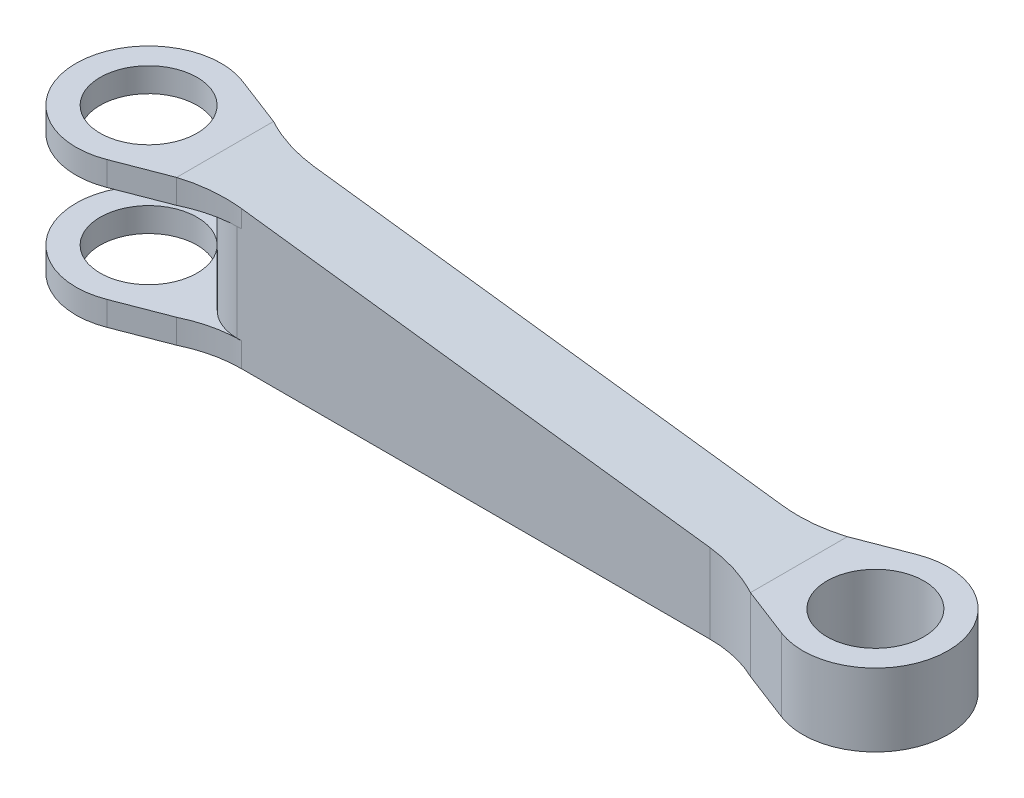
ISO-10303-21;
HEADER;
FILE_DESCRIPTION(('STEP AP214'),'2;1');
FILE_NAME('part.step','',(''),(''),'','','');
FILE_SCHEMA(('AUTOMOTIVE_DESIGN { 1 0 10303 214 1 1 1 1 }'));
ENDSEC;
DATA;
#1=APPLICATION_CONTEXT('core data for automotive mechanical design processes');
#2=APPLICATION_PROTOCOL_DEFINITION('international standard','automotive_design',2000,#1);
#3=PRODUCT_CONTEXT('',#1,'mechanical');
#4=PRODUCT('Part','Part','',(#3));
#5=PRODUCT_RELATED_PRODUCT_CATEGORY('part','',(#4));
#6=PRODUCT_DEFINITION_FORMATION('','',#4);
#7=PRODUCT_DEFINITION_CONTEXT('part definition',#1,'design');
#8=PRODUCT_DEFINITION('design','',#6,#7);
#9=PRODUCT_DEFINITION_SHAPE('','',#8);
#10=(LENGTH_UNIT() NAMED_UNIT(*) SI_UNIT(.MILLI.,.METRE.));
#11=(NAMED_UNIT(*) PLANE_ANGLE_UNIT() SI_UNIT($,.RADIAN.));
#12=(NAMED_UNIT(*) SI_UNIT($,.STERADIAN.) SOLID_ANGLE_UNIT());
#13=UNCERTAINTY_MEASURE_WITH_UNIT(LENGTH_MEASURE(1.E-05),#10,'distance_accuracy_value','');
#14=(GEOMETRIC_REPRESENTATION_CONTEXT(3) GLOBAL_UNCERTAINTY_ASSIGNED_CONTEXT((#13)) GLOBAL_UNIT_ASSIGNED_CONTEXT((#10,
#11,#12)) REPRESENTATION_CONTEXT('',''));
#15=CARTESIAN_POINT('',(0.,0.,0.));
#16=DIRECTION('',(0.,0.,1.));
#17=DIRECTION('',(1.,0.,0.));
#18=AXIS2_PLACEMENT_3D('',#15,#16,#17);
#19=CARTESIAN_POINT('',(0.,7.62,0.));
#20=DIRECTION('',(0.,-1.,0.));
#21=DIRECTION('',(0.,0.,-1.));
#22=AXIS2_PLACEMENT_3D('',#19,#20,#21);
#23=CYLINDRICAL_SURFACE('',#22,7.62);
#24=CARTESIAN_POINT('',(0.,-5.08,0.));
#25=DIRECTION('',(0.,-1.,0.));
#26=DIRECTION('',(0.,0.,-1.));
#27=AXIS2_PLACEMENT_3D('',#24,#25,#26);
#28=CIRCLE('',#27,7.62);
#29=CARTESIAN_POINT('',(2.73566372202433,-5.08,7.112));
#30=VERTEX_POINT('',#29);
#31=CARTESIAN_POINT('',(2.73566372202433,-5.08,-7.112));
#32=VERTEX_POINT('',#31);
#33=EDGE_CURVE('E183',#30,#32,#28,.T.);
#34=ORIENTED_EDGE('',*,*,#33,.T.);
#35=DIRECTION('',(0.,-1.,0.));
#36=VECTOR('',#35,1.);
#37=CARTESIAN_POINT('',(2.73566372202433,7.62,-7.112));
#38=LINE('',#37,#36);
#39=CARTESIAN_POINT('',(2.73566372202433,-7.62,-7.112));
#40=VERTEX_POINT('',#39);
#41=EDGE_CURVE('E337',#32,#40,#38,.T.);
#42=ORIENTED_EDGE('',*,*,#41,.T.);
#43=CARTESIAN_POINT('',(0.,-7.62,0.));
#44=DIRECTION('',(0.,1.,0.));
#45=DIRECTION('',(0.,0.,1.));
#46=AXIS2_PLACEMENT_3D('',#43,#44,#45);
#47=CIRCLE('',#46,7.62);
#48=CARTESIAN_POINT('',(2.73566372202433,-7.62,7.112));
#49=VERTEX_POINT('',#48);
#50=EDGE_CURVE('E332',#40,#49,#47,.T.);
#51=ORIENTED_EDGE('',*,*,#50,.T.);
#52=DIRECTION('',(0.,-1.,0.));
#53=VECTOR('',#52,1.);
#54=CARTESIAN_POINT('',(2.73566372202433,7.62,7.112));
#55=LINE('',#54,#53);
#56=EDGE_CURVE('E320',#30,#49,#55,.T.);
#57=ORIENTED_EDGE('',*,*,#56,.F.);
#58=EDGE_LOOP('',(#34,#42,#51,#57));
#59=FACE_BOUND('',#58,.T.);
#60=ADVANCED_FACE('F34',(#59),#23,.T.);
#61=CARTESIAN_POINT('',(2.73566372202433,7.62,7.112));
#62=DIRECTION('',(-0.359010987142301,0.,-0.933333333333333));
#63=DIRECTION('',(-0.933333333333333,0.,0.359010987142301));
#64=AXIS2_PLACEMENT_3D('',#61,#62,#63);
#65=PLANE('',#64);
#66=CARTESIAN_POINT('',(2.73566372202433,7.62,7.112));
#67=VERTEX_POINT('',#66);
#68=CARTESIAN_POINT('',(2.73566372202433,5.08,7.112));
#69=VERTEX_POINT('',#68);
#70=EDGE_CURVE('E255',#67,#69,#55,.T.);
#71=ORIENTED_EDGE('',*,*,#70,.T.);
#72=DIRECTION('',(0.933333333333333,0.,-0.359010987142301));
#73=VECTOR('',#72,1.);
#74=CARTESIAN_POINT('',(2.73566372202433,5.08,7.112));
#75=LINE('',#74,#73);
#76=CARTESIAN_POINT('',(8.01832470248509,5.08,5.08));
#77=VERTEX_POINT('',#76);
#78=EDGE_CURVE('E389',#69,#77,#75,.T.);
#79=ORIENTED_EDGE('',*,*,#78,.T.);
#80=DIRECTION('',(0.,-1.,0.));
#81=VECTOR('',#80,1.);
#82=CARTESIAN_POINT('',(8.01832470248509,7.62,5.08));
#83=LINE('',#82,#81);
#84=CARTESIAN_POINT('',(8.01832470248509,7.62,5.08));
#85=VERTEX_POINT('',#84);
#86=EDGE_CURVE('E195',#85,#77,#83,.T.);
#87=ORIENTED_EDGE('',*,*,#86,.F.);
#88=DIRECTION('',(0.933333333333333,0.,-0.359010987142301));
#89=VECTOR('',#88,1.);
#90=CARTESIAN_POINT('',(2.73566372202433,7.62,7.112));
#91=LINE('',#90,#89);
#92=EDGE_CURVE('E364',#67,#85,#91,.T.);
#93=ORIENTED_EDGE('',*,*,#92,.F.);
#94=EDGE_LOOP('',(#71,#79,#87,#93));
#95=FACE_BOUND('',#94,.T.);
#96=ADVANCED_FACE('F408',(#95),#65,.F.);
#97=CARTESIAN_POINT('',(2.73566372202433,7.62,-7.112));
#98=DIRECTION('',(-0.359010987142301,0.,0.933333333333333));
#99=DIRECTION('',(0.933333333333333,0.,0.359010987142301));
#100=AXIS2_PLACEMENT_3D('',#97,#98,#99);
#101=PLANE('',#100);
#102=DIRECTION('',(0.,-1.,0.));
#103=VECTOR('',#102,1.);
#104=CARTESIAN_POINT('',(8.01832470248509,7.62,-5.08));
#105=LINE('',#104,#103);
#106=CARTESIAN_POINT('',(8.01832470248509,7.62,-5.08));
#107=VERTEX_POINT('',#106);
#108=CARTESIAN_POINT('',(8.01832470248509,5.08,-5.08));
#109=VERTEX_POINT('',#108);
#110=EDGE_CURVE('E298',#107,#109,#105,.T.);
#111=ORIENTED_EDGE('',*,*,#110,.T.);
#112=DIRECTION('',(-0.933333333333333,0.,-0.359010987142301));
#113=VECTOR('',#112,1.);
#114=CARTESIAN_POINT('',(2.73566372202433,5.08,-7.112));
#115=LINE('',#114,#113);
#116=CARTESIAN_POINT('',(2.73566372202433,5.08,-7.112));
#117=VERTEX_POINT('',#116);
#118=EDGE_CURVE('E250',#109,#117,#115,.T.);
#119=ORIENTED_EDGE('',*,*,#118,.T.);
#120=CARTESIAN_POINT('',(2.73566372202433,7.62,-7.112));
#121=VERTEX_POINT('',#120);
#122=EDGE_CURVE('E311',#121,#117,#38,.T.);
#123=ORIENTED_EDGE('',*,*,#122,.F.);
#124=DIRECTION('',(-0.933333333333333,0.,-0.359010987142301));
#125=VECTOR('',#124,1.);
#126=CARTESIAN_POINT('',(2.73566372202433,7.62,-7.112));
#127=LINE('',#126,#125);
#128=EDGE_CURVE('E345',#107,#121,#127,.T.);
#129=ORIENTED_EDGE('',*,*,#128,.F.);
#130=EDGE_LOOP('',(#111,#119,#123,#129));
#131=FACE_BOUND('',#130,.T.);
#132=ADVANCED_FACE('F402',(#131),#101,.F.);
#133=CARTESIAN_POINT('',(0.,7.62,0.));
#134=DIRECTION('',(0.,-1.,0.));
#135=DIRECTION('',(0.,0.,-1.));
#136=AXIS2_PLACEMENT_3D('',#133,#134,#135);
#137=CYLINDRICAL_SURFACE('',#136,5.08);
#138=CARTESIAN_POINT('',(0.,5.08,0.));
#139=DIRECTION('',(0.,1.,0.));
#140=DIRECTION('',(0.,0.,1.));
#141=AXIS2_PLACEMENT_3D('',#138,#139,#140);
#142=CIRCLE('',#141,5.08);
#143=CARTESIAN_POINT('',(0.,5.08,-5.08));
#144=VERTEX_POINT('',#143);
#145=EDGE_CURVE('E186',#144,#144,#142,.T.);
#146=CARTESIAN_POINT('',(0.,7.62,0.));
#147=DIRECTION('',(0.,1.,0.));
#148=DIRECTION('',(0.,0.,1.));
#149=AXIS2_PLACEMENT_3D('',#146,#147,#148);
#150=CIRCLE('',#149,5.08);
#151=CARTESIAN_POINT('',(0.,7.62,-5.08));
#152=VERTEX_POINT('',#151);
#153=EDGE_CURVE('E339',#152,#152,#150,.T.);
#154=CARTESIAN_POINT('',(0.,5.08,-5.08));
#155=CARTESIAN_POINT('',(0.,5.10645833333333,-5.08));
#156=CARTESIAN_POINT('',(0.,5.13291666666667,-5.08));
#157=CARTESIAN_POINT('',(0.,5.18583333333333,-5.08));
#158=CARTESIAN_POINT('',(0.,5.21229166666667,-5.08));
#159=CARTESIAN_POINT('',(0.,5.26520833333333,-5.08));
#160=CARTESIAN_POINT('',(0.,5.29166666666667,-5.08));
#161=CARTESIAN_POINT('',(0.,5.34458333333333,-5.08));
#162=CARTESIAN_POINT('',(0.,5.37104166666667,-5.08));
#163=CARTESIAN_POINT('',(0.,5.42395833333333,-5.08));
#164=CARTESIAN_POINT('',(0.,5.45041666666667,-5.08));
#165=CARTESIAN_POINT('',(0.,5.50333333333333,-5.08));
#166=CARTESIAN_POINT('',(0.,5.52979166666667,-5.08));
#167=CARTESIAN_POINT('',(0.,5.58270833333333,-5.08));
#168=CARTESIAN_POINT('',(0.,5.60916666666667,-5.08));
#169=CARTESIAN_POINT('',(0.,5.66208333333333,-5.08));
#170=CARTESIAN_POINT('',(0.,5.68854166666667,-5.08));
#171=CARTESIAN_POINT('',(0.,5.74145833333333,-5.08));
#172=CARTESIAN_POINT('',(0.,5.76791666666667,-5.08));
#173=CARTESIAN_POINT('',(0.,5.82083333333333,-5.08));
#174=CARTESIAN_POINT('',(0.,5.84729166666667,-5.08));
#175=CARTESIAN_POINT('',(0.,5.90020833333333,-5.08));
#176=CARTESIAN_POINT('',(0.,5.92666666666667,-5.08));
#177=CARTESIAN_POINT('',(0.,5.97958333333333,-5.08));
#178=CARTESIAN_POINT('',(0.,6.00604166666667,-5.08));
#179=CARTESIAN_POINT('',(0.,6.05895833333333,-5.08));
#180=CARTESIAN_POINT('',(0.,6.08541666666667,-5.08));
#181=CARTESIAN_POINT('',(0.,6.13833333333333,-5.08));
#182=CARTESIAN_POINT('',(0.,6.16479166666667,-5.08));
#183=CARTESIAN_POINT('',(0.,6.21770833333333,-5.08));
#184=CARTESIAN_POINT('',(0.,6.24416666666667,-5.08));
#185=CARTESIAN_POINT('',(0.,6.29708333333333,-5.08));
#186=CARTESIAN_POINT('',(0.,6.32354166666667,-5.08));
#187=CARTESIAN_POINT('',(0.,6.37645833333333,-5.08));
#188=CARTESIAN_POINT('',(0.,6.40291666666667,-5.08));
#189=CARTESIAN_POINT('',(0.,6.45583333333333,-5.08));
#190=CARTESIAN_POINT('',(0.,6.48229166666667,-5.08));
#191=CARTESIAN_POINT('',(0.,6.53520833333333,-5.08));
#192=CARTESIAN_POINT('',(0.,6.56166666666667,-5.08));
#193=CARTESIAN_POINT('',(0.,6.61458333333333,-5.08));
#194=CARTESIAN_POINT('',(0.,6.64104166666667,-5.08));
#195=CARTESIAN_POINT('',(0.,6.69395833333333,-5.08));
#196=CARTESIAN_POINT('',(0.,6.72041666666667,-5.08));
#197=CARTESIAN_POINT('',(0.,6.77333333333333,-5.08));
#198=CARTESIAN_POINT('',(0.,6.79979166666667,-5.08));
#199=CARTESIAN_POINT('',(0.,6.85270833333333,-5.08));
#200=CARTESIAN_POINT('',(0.,6.87916666666667,-5.08));
#201=CARTESIAN_POINT('',(0.,6.93208333333333,-5.08));
#202=CARTESIAN_POINT('',(0.,6.95854166666667,-5.08));
#203=CARTESIAN_POINT('',(0.,7.01145833333333,-5.08));
#204=CARTESIAN_POINT('',(0.,7.03791666666667,-5.08));
#205=CARTESIAN_POINT('',(0.,7.09083333333333,-5.08));
#206=CARTESIAN_POINT('',(0.,7.11729166666667,-5.08));
#207=CARTESIAN_POINT('',(0.,7.17020833333333,-5.08));
#208=CARTESIAN_POINT('',(0.,7.19666666666667,-5.08));
#209=CARTESIAN_POINT('',(0.,7.24958333333333,-5.08));
#210=CARTESIAN_POINT('',(0.,7.27604166666667,-5.08));
#211=CARTESIAN_POINT('',(0.,7.32895833333333,-5.08));
#212=CARTESIAN_POINT('',(0.,7.35541666666667,-5.08));
#213=CARTESIAN_POINT('',(0.,7.40833333333333,-5.08));
#214=CARTESIAN_POINT('',(0.,7.43479166666667,-5.08));
#215=CARTESIAN_POINT('',(0.,7.48770833333333,-5.08));
#216=CARTESIAN_POINT('',(0.,7.51416666666667,-5.08));
#217=CARTESIAN_POINT('',(0.,7.56708333333333,-5.08));
#218=CARTESIAN_POINT('',(0.,7.59354166666667,-5.08));
#219=CARTESIAN_POINT('',(0.,7.62,-5.08));
#220=B_SPLINE_CURVE_WITH_KNOTS('',3,(#154,#155,#156,#157,#158,#159,#160,#161,#162,#163,#164,
#165,#166,#167,#168,#169,#170,#171,#172,#173,#174,#175,#176,#177,#178,#179,#180,#181,#182,#183,
#184,#185,#186,#187,#188,#189,#190,#191,#192,#193,#194,#195,#196,#197,#198,#199,#200,#201,#202,
#203,#204,#205,#206,#207,#208,#209,#210,#211,#212,#213,#214,#215,#216,#217,#218,#219),
.UNSPECIFIED.,.F.,.F.,(4,2,2,2,2,2,2,2,2,2,2,2,2,2,2,2,2,2,2,2,2,2,2,2,2,2,2,2,2,2,2,2,4),(0.,
0.0793749999999996,0.158749999999999,0.238125,0.3175,0.396875,0.476249999999999,0.555625,
0.634999999999999,0.714375,0.793749999999999,0.873125,0.952499999999999,1.031875,1.11125,
1.190625,1.27,1.349375,1.42875,1.508125,1.5875,1.666875,1.74625,1.825625,1.905,1.984375,2.06375,
2.143125,2.2225,2.301875,2.38125,2.460625,2.54),.UNSPECIFIED.);
#221=EDGE_CURVE('BSEAM461',#144,#152,#220,.T.);
#222=ORIENTED_EDGE('',*,*,#145,.F.);
#223=ORIENTED_EDGE('',*,*,#153,.T.);
#224=ORIENTED_EDGE('',*,*,#221,.T.);
#225=ORIENTED_EDGE('',*,*,#221,.F.);
#226=EDGE_LOOP('',(#222,#224,#223,#225));
#227=FACE_BOUND('',#226,.T.);
#228=ADVANCED_FACE('F461',(#227),#137,.F.);
#229=CARTESIAN_POINT('',(0.,7.62,0.));
#230=DIRECTION('',(0.,1.,0.));
#231=DIRECTION('',(0.,0.,1.));
#232=AXIS2_PLACEMENT_3D('',#229,#230,#231);
#233=PLANE('',#232);
#234=DIRECTION('',(0.,0.,1.));
#235=VECTOR('',#234,1.);
#236=CARTESIAN_POINT('',(8.01832470248509,7.62,-7.62));
#237=LINE('',#236,#235);
#238=EDGE_CURVE('E291',#107,#85,#237,.T.);
#239=ORIENTED_EDGE('',*,*,#238,.F.);
#240=ORIENTED_EDGE('',*,*,#128,.T.);
#241=CARTESIAN_POINT('',(0.,7.62,0.));
#242=DIRECTION('',(0.,1.,0.));
#243=DIRECTION('',(0.,0.,1.));
#244=AXIS2_PLACEMENT_3D('',#241,#242,#243);
#245=CIRCLE('',#244,7.62);
#246=EDGE_CURVE('E361',#121,#67,#245,.T.);
#247=ORIENTED_EDGE('',*,*,#246,.T.);
#248=ORIENTED_EDGE('',*,*,#92,.T.);
#249=EDGE_LOOP('',(#239,#240,#247,#248));
#250=FACE_BOUND('',#249,.T.);
#251=ORIENTED_EDGE('',*,*,#153,.F.);
#252=EDGE_LOOP('',(#251));
#253=FACE_BOUND('',#252,.T.);
#254=ADVANCED_FACE('F400',(#250,#253),#233,.T.);
#255=CARTESIAN_POINT('',(0.,-7.62,0.));
#256=DIRECTION('',(0.,1.,0.));
#257=DIRECTION('',(0.,0.,1.));
#258=AXIS2_PLACEMENT_3D('',#255,#256,#257);
#259=PLANE('',#258);
#260=CARTESIAN_POINT('',(0.,-7.62,0.));
#261=DIRECTION('',(0.,1.,0.));
#262=DIRECTION('',(0.,0.,1.));
#263=AXIS2_PLACEMENT_3D('',#260,#261,#262);
#264=CIRCLE('',#263,5.08);
#265=CARTESIAN_POINT('',(0.,-7.62,-5.08));
#266=VERTEX_POINT('',#265);
#267=EDGE_CURVE('E342',#266,#266,#264,.T.);
#268=ORIENTED_EDGE('',*,*,#267,.T.);
#269=EDGE_LOOP('',(#268));
#270=FACE_BOUND('',#269,.T.);
#271=ORIENTED_EDGE('',*,*,#50,.F.);
#272=DIRECTION('',(-0.933333333333333,0.,-0.359010987142301));
#273=VECTOR('',#272,1.);
#274=CARTESIAN_POINT('',(2.73566372202433,-7.62,-7.112));
#275=LINE('',#274,#273);
#276=CARTESIAN_POINT('',(8.01832470248509,-7.62,-5.08));
#277=VERTEX_POINT('',#276);
#278=EDGE_CURVE('E360',#277,#40,#275,.T.);
#279=ORIENTED_EDGE('',*,*,#278,.F.);
#280=CARTESIAN_POINT('',(13.5541263607818,-7.62,-16.51));
#281=DIRECTION('',(0.,1.,0.));
#282=DIRECTION('',(0.,0.,1.));
#283=AXIS2_PLACEMENT_3D('',#280,#281,#282);
#284=CIRCLE('',#283,12.7);
#285=CARTESIAN_POINT('',(13.5541263607818,-7.62,-3.81));
#286=VERTEX_POINT('',#285);
#287=EDGE_CURVE('E279',#277,#286,#284,.T.);
#288=ORIENTED_EDGE('',*,*,#287,.T.);
#289=DIRECTION('',(-1.,0.,0.));
#290=VECTOR('',#289,1.);
#291=CARTESIAN_POINT('',(8.01832470248509,-7.62,-3.81));
#292=LINE('',#291,#290);
#293=CARTESIAN_POINT('',(62.6458736392183,-7.62,-3.81));
#294=VERTEX_POINT('',#293);
#295=EDGE_CURVE('E359',#294,#286,#292,.T.);
#296=ORIENTED_EDGE('',*,*,#295,.F.);
#297=CARTESIAN_POINT('',(62.6458736392183,-7.62,-16.51));
#298=DIRECTION('',(0.,1.,0.));
#299=DIRECTION('',(0.,0.,1.));
#300=AXIS2_PLACEMENT_3D('',#297,#298,#299);
#301=CIRCLE('',#300,12.7);
#302=CARTESIAN_POINT('',(68.1816752975149,-7.62,-5.08));
#303=VERTEX_POINT('',#302);
#304=EDGE_CURVE('E275',#294,#303,#301,.T.);
#305=ORIENTED_EDGE('',*,*,#304,.T.);
#306=DIRECTION('',(-0.933333333333333,0.,0.359010987142301));
#307=VECTOR('',#306,1.);
#308=CARTESIAN_POINT('',(68.1816752975149,-7.62,-5.08));
#309=LINE('',#308,#307);
#310=CARTESIAN_POINT('',(73.4643362779757,-7.62,-7.112));
#311=VERTEX_POINT('',#310);
#312=EDGE_CURVE('E356',#311,#303,#309,.T.);
#313=ORIENTED_EDGE('',*,*,#312,.F.);
#314=CARTESIAN_POINT('',(76.2,-7.62,0.));
#315=DIRECTION('',(0.,1.,0.));
#316=DIRECTION('',(0.,0.,-1.));
#317=AXIS2_PLACEMENT_3D('',#314,#315,#316);
#318=CIRCLE('',#317,7.62);
#319=CARTESIAN_POINT('',(73.4643362779757,-7.62,7.112));
#320=VERTEX_POINT('',#319);
#321=EDGE_CURVE('E353',#320,#311,#318,.T.);
#322=ORIENTED_EDGE('',*,*,#321,.F.);
#323=DIRECTION('',(0.933333333333333,0.,0.359010987142301));
#324=VECTOR('',#323,1.);
#325=CARTESIAN_POINT('',(68.1816752975149,-7.62,5.08));
#326=LINE('',#325,#324);
#327=CARTESIAN_POINT('',(68.1816752975149,-7.62,5.08));
#328=VERTEX_POINT('',#327);
#329=EDGE_CURVE('E350',#328,#320,#326,.T.);
#330=ORIENTED_EDGE('',*,*,#329,.F.);
#331=CARTESIAN_POINT('',(62.6458736392183,-7.62,16.51));
#332=DIRECTION('',(0.,1.,0.));
#333=DIRECTION('',(0.,0.,1.));
#334=AXIS2_PLACEMENT_3D('',#331,#332,#333);
#335=CIRCLE('',#334,12.7);
#336=CARTESIAN_POINT('',(62.6458736392183,-7.62,3.81));
#337=VERTEX_POINT('',#336);
#338=EDGE_CURVE('E270',#328,#337,#335,.T.);
#339=ORIENTED_EDGE('',*,*,#338,.T.);
#340=DIRECTION('',(1.,0.,0.));
#341=VECTOR('',#340,1.);
#342=CARTESIAN_POINT('',(8.01832470248509,-7.62,3.81));
#343=LINE('',#342,#341);
#344=CARTESIAN_POINT('',(13.5541263607817,-7.62,3.81));
#345=VERTEX_POINT('',#344);
#346=EDGE_CURVE('E334',#345,#337,#343,.T.);
#347=ORIENTED_EDGE('',*,*,#346,.F.);
#348=CARTESIAN_POINT('',(13.5541263607817,-7.62,16.51));
#349=DIRECTION('',(0.,1.,0.));
#350=DIRECTION('',(0.,0.,1.));
#351=AXIS2_PLACEMENT_3D('',#348,#349,#350);
#352=CIRCLE('',#351,12.7);
#353=CARTESIAN_POINT('',(8.01832470248509,-7.62,5.08));
#354=VERTEX_POINT('',#353);
#355=EDGE_CURVE('E202',#345,#354,#352,.T.);
#356=ORIENTED_EDGE('',*,*,#355,.T.);
#357=DIRECTION('',(0.933333333333333,0.,-0.359010987142301));
#358=VECTOR('',#357,1.);
#359=CARTESIAN_POINT('',(2.73566372202433,-7.62,7.112));
#360=LINE('',#359,#358);
#361=EDGE_CURVE('E193',#49,#354,#360,.T.);
#362=ORIENTED_EDGE('',*,*,#361,.F.);
#363=EDGE_LOOP('',(#271,#279,#288,#296,#305,#313,#322,#330,#339,#347,#356,#362));
#364=FACE_BOUND('',#363,.T.);
#365=CARTESIAN_POINT('',(76.2,-7.62,0.));
#366=DIRECTION('',(0.,1.,0.));
#367=DIRECTION('',(0.,0.,1.));
#368=AXIS2_PLACEMENT_3D('',#365,#366,#367);
#369=CIRCLE('',#368,5.08);
#370=CARTESIAN_POINT('',(76.2,-7.62,-5.08));
#371=VERTEX_POINT('',#370);
#372=EDGE_CURVE('E370',#371,#371,#369,.T.);
#373=ORIENTED_EDGE('',*,*,#372,.T.);
#374=EDGE_LOOP('',(#373));
#375=FACE_BOUND('',#374,.T.);
#376=ADVANCED_FACE('F329',(#270,#364,#375),#259,.F.);
#377=ORIENTED_EDGE('',*,*,#122,.T.);
#378=CARTESIAN_POINT('',(0.,5.08,0.));
#379=DIRECTION('',(0.,1.,0.));
#380=DIRECTION('',(0.,0.,1.));
#381=AXIS2_PLACEMENT_3D('',#378,#379,#380);
#382=CIRCLE('',#381,7.62);
#383=EDGE_CURVE('E392',#117,#69,#382,.T.);
#384=ORIENTED_EDGE('',*,*,#383,.T.);
#385=ORIENTED_EDGE('',*,*,#70,.F.);
#386=ORIENTED_EDGE('',*,*,#246,.F.);
#387=EDGE_LOOP('',(#377,#384,#385,#386));
#388=FACE_BOUND('',#387,.T.);
#389=ADVANCED_FACE('F404',(#388),#23,.T.);
#390=CARTESIAN_POINT('',(8.01832470248509,-5.08,5.08));
#391=VERTEX_POINT('',#390);
#392=EDGE_CURVE('E190',#391,#354,#83,.T.);
#393=ORIENTED_EDGE('',*,*,#392,.F.);
#394=DIRECTION('',(-0.933333333333333,0.,0.359010987142301));
#395=VECTOR('',#394,1.);
#396=CARTESIAN_POINT('',(2.73566372202433,-5.08,7.112));
#397=LINE('',#396,#395);
#398=EDGE_CURVE('E176',#391,#30,#397,.T.);
#399=ORIENTED_EDGE('',*,*,#398,.T.);
#400=ORIENTED_EDGE('',*,*,#56,.T.);
#401=ORIENTED_EDGE('',*,*,#361,.T.);
#402=EDGE_LOOP('',(#393,#399,#400,#401));
#403=FACE_BOUND('',#402,.T.);
#404=ADVANCED_FACE('F191',(#403),#65,.F.);
#405=CARTESIAN_POINT('',(8.01832470248509,7.62,3.81));
#406=DIRECTION('',(0.,0.,-1.));
#407=DIRECTION('',(-1.,0.,0.));
#408=AXIS2_PLACEMENT_3D('',#405,#406,#407);
#409=PLANE('',#408);
#410=DIRECTION('',(-1.,0.,0.));
#411=VECTOR('',#410,1.);
#412=CARTESIAN_POINT('',(-7.62,5.08,3.81));
#413=LINE('',#412,#411);
#414=CARTESIAN_POINT('',(13.5541263607817,5.08,3.81));
#415=VERTEX_POINT('',#414);
#416=CARTESIAN_POINT('',(13.0983247024851,5.08,3.81));
#417=VERTEX_POINT('',#416);
#418=EDGE_CURVE('E251',#415,#417,#413,.T.);
#419=ORIENTED_EDGE('',*,*,#418,.T.);
#420=DIRECTION('',(0.,-1.,0.));
#421=VECTOR('',#420,1.);
#422=CARTESIAN_POINT('',(13.0983247024851,7.62,3.81));
#423=LINE('',#422,#421);
#424=CARTESIAN_POINT('',(13.0983247024851,-5.08,3.81));
#425=VERTEX_POINT('',#424);
#426=EDGE_CURVE('E214',#417,#425,#423,.T.);
#427=ORIENTED_EDGE('',*,*,#426,.T.);
#428=DIRECTION('',(1.,0.,0.));
#429=VECTOR('',#428,1.);
#430=CARTESIAN_POINT('',(-7.62,-5.08,3.81));
#431=LINE('',#430,#429);
#432=CARTESIAN_POINT('',(13.5541263607817,-5.08,3.81));
#433=VERTEX_POINT('',#432);
#434=EDGE_CURVE('E258',#425,#433,#431,.T.);
#435=ORIENTED_EDGE('',*,*,#434,.T.);
#436=DIRECTION('',(0.,-1.,0.));
#437=VECTOR('',#436,1.);
#438=CARTESIAN_POINT('',(13.5541263607817,7.62,3.81));
#439=LINE('',#438,#437);
#440=EDGE_CURVE('E200',#433,#345,#439,.T.);
#441=ORIENTED_EDGE('',*,*,#440,.T.);
#442=ORIENTED_EDGE('',*,*,#346,.T.);
#443=DIRECTION('',(0.,1.,0.));
#444=VECTOR('',#443,1.);
#445=CARTESIAN_POINT('',(62.6458736392183,7.62,3.81));
#446=LINE('',#445,#444);
#447=CARTESIAN_POINT('',(62.6458736392183,0.701137955566348,3.81));
#448=VERTEX_POINT('',#447);
#449=EDGE_CURVE('E261',#337,#448,#446,.T.);
#450=ORIENTED_EDGE('',*,*,#449,.T.);
#451=DIRECTION('',(-0.9920744596049,0.125651369270877,0.));
#452=VECTOR('',#451,1.);
#453=CARTESIAN_POINT('',(8.01832470248509,7.62,3.81));
#454=LINE('',#453,#452);
#455=CARTESIAN_POINT('',(13.5541263607817,6.91886204443365,3.81));
#456=VERTEX_POINT('',#455);
#457=EDGE_CURVE('E374',#448,#456,#454,.T.);
#458=ORIENTED_EDGE('',*,*,#457,.T.);
#459=DIRECTION('',(0.,-1.,0.));
#460=VECTOR('',#459,1.);
#461=CARTESIAN_POINT('',(13.5541263607817,7.62,3.81));
#462=LINE('',#461,#460);
#463=EDGE_CURVE('E254',#456,#415,#462,.T.);
#464=ORIENTED_EDGE('',*,*,#463,.T.);
#465=EDGE_LOOP('',(#419,#427,#435,#441,#442,#450,#458,#464));
#466=FACE_BOUND('',#465,.T.);
#467=ADVANCED_FACE('F416',(#466),#409,.F.);
#468=CARTESIAN_POINT('',(68.1816752975149,7.62,5.08));
#469=DIRECTION('',(0.359010987142301,0.,-0.933333333333333));
#470=DIRECTION('',(-0.933333333333333,0.,-0.359010987142301));
#471=AXIS2_PLACEMENT_3D('',#468,#469,#470);
#472=PLANE('',#471);
#473=DIRECTION('',(0.,-1.,0.));
#474=VECTOR('',#473,1.);
#475=CARTESIAN_POINT('',(73.4643362779757,7.62,7.112));
#476=LINE('',#475,#474);
#477=CARTESIAN_POINT('',(73.4643362779757,0.,7.112));
#478=VERTEX_POINT('',#477);
#479=EDGE_CURVE('E316',#478,#320,#476,.T.);
#480=ORIENTED_EDGE('',*,*,#479,.F.);
#481=DIRECTION('',(-0.933333333333333,0.,-0.359010987142301));
#482=VECTOR('',#481,1.);
#483=CARTESIAN_POINT('',(68.1816752975149,0.,5.08));
#484=LINE('',#483,#482);
#485=CARTESIAN_POINT('',(68.1816752975149,0.,5.08));
#486=VERTEX_POINT('',#485);
#487=EDGE_CURVE('E378',#478,#486,#484,.T.);
#488=ORIENTED_EDGE('',*,*,#487,.T.);
#489=DIRECTION('',(0.,-1.,0.));
#490=VECTOR('',#489,1.);
#491=CARTESIAN_POINT('',(68.1816752975149,7.62,5.08));
#492=LINE('',#491,#490);
#493=EDGE_CURVE('E196',#486,#328,#492,.T.);
#494=ORIENTED_EDGE('',*,*,#493,.T.);
#495=ORIENTED_EDGE('',*,*,#329,.T.);
#496=EDGE_LOOP('',(#480,#488,#494,#495));
#497=FACE_BOUND('',#496,.T.);
#498=ADVANCED_FACE('F475',(#497),#472,.F.);
#499=CARTESIAN_POINT('',(76.2,7.62,0.));
#500=DIRECTION('',(0.,-1.,0.));
#501=DIRECTION('',(0.,0.,-1.));
#502=AXIS2_PLACEMENT_3D('',#499,#500,#501);
#503=CYLINDRICAL_SURFACE('',#502,7.62);
#504=DIRECTION('',(0.,-1.,0.));
#505=VECTOR('',#504,1.);
#506=CARTESIAN_POINT('',(73.4643362779757,7.62,-7.112));
#507=LINE('',#506,#505);
#508=CARTESIAN_POINT('',(73.4643362779757,0.,-7.112));
#509=VERTEX_POINT('',#508);
#510=EDGE_CURVE('E308',#509,#311,#507,.T.);
#511=ORIENTED_EDGE('',*,*,#510,.F.);
#512=CARTESIAN_POINT('',(76.2,0.,0.));
#513=DIRECTION('',(0.,-1.,0.));
#514=DIRECTION('',(0.,0.,-1.));
#515=AXIS2_PLACEMENT_3D('',#512,#513,#514);
#516=CIRCLE('',#515,7.62);
#517=EDGE_CURVE('E381',#509,#478,#516,.T.);
#518=ORIENTED_EDGE('',*,*,#517,.T.);
#519=ORIENTED_EDGE('',*,*,#479,.T.);
#520=ORIENTED_EDGE('',*,*,#321,.T.);
#521=EDGE_LOOP('',(#511,#518,#519,#520));
#522=FACE_BOUND('',#521,.T.);
#523=ADVANCED_FACE('F472',(#522),#503,.T.);
#524=CARTESIAN_POINT('',(68.1816752975149,7.62,-5.08));
#525=DIRECTION('',(0.359010987142301,0.,0.933333333333333));
#526=DIRECTION('',(0.933333333333333,0.,-0.359010987142301));
#527=AXIS2_PLACEMENT_3D('',#524,#525,#526);
#528=PLANE('',#527);
#529=DIRECTION('',(0.,-1.,0.));
#530=VECTOR('',#529,1.);
#531=CARTESIAN_POINT('',(68.1816752975149,7.62,-5.08));
#532=LINE('',#531,#530);
#533=CARTESIAN_POINT('',(68.1816752975149,0.,-5.08));
#534=VERTEX_POINT('',#533);
#535=EDGE_CURVE('E304',#534,#303,#532,.T.);
#536=ORIENTED_EDGE('',*,*,#535,.F.);
#537=DIRECTION('',(0.933333333333333,0.,-0.359010987142301));
#538=VECTOR('',#537,1.);
#539=CARTESIAN_POINT('',(68.1816752975149,0.,-5.08));
#540=LINE('',#539,#538);
#541=EDGE_CURVE('E384',#534,#509,#540,.T.);
#542=ORIENTED_EDGE('',*,*,#541,.T.);
#543=ORIENTED_EDGE('',*,*,#510,.T.);
#544=ORIENTED_EDGE('',*,*,#312,.T.);
#545=EDGE_LOOP('',(#536,#542,#543,#544));
#546=FACE_BOUND('',#545,.T.);
#547=ADVANCED_FACE('F428',(#546),#528,.F.);
#548=CARTESIAN_POINT('',(8.01832470248509,7.62,-3.81));
#549=DIRECTION('',(0.,0.,1.));
#550=DIRECTION('',(1.,0.,0.));
#551=AXIS2_PLACEMENT_3D('',#548,#549,#550);
#552=PLANE('',#551);
#553=DIRECTION('',(-1.,0.,0.));
#554=VECTOR('',#553,1.);
#555=CARTESIAN_POINT('',(-7.62,-5.08,-3.81));
#556=LINE('',#555,#554);
#557=CARTESIAN_POINT('',(13.5541263607818,-5.08,-3.81));
#558=VERTEX_POINT('',#557);
#559=CARTESIAN_POINT('',(13.0983247024851,-5.08,-3.81));
#560=VERTEX_POINT('',#559);
#561=EDGE_CURVE('E221',#558,#560,#556,.T.);
#562=ORIENTED_EDGE('',*,*,#561,.T.);
#563=DIRECTION('',(0.,1.,0.));
#564=VECTOR('',#563,1.);
#565=CARTESIAN_POINT('',(13.0983247024851,7.62,-3.81));
#566=LINE('',#565,#564);
#567=CARTESIAN_POINT('',(13.0983247024851,5.08,-3.81));
#568=VERTEX_POINT('',#567);
#569=EDGE_CURVE('E211',#560,#568,#566,.T.);
#570=ORIENTED_EDGE('',*,*,#569,.T.);
#571=DIRECTION('',(1.,0.,0.));
#572=VECTOR('',#571,1.);
#573=CARTESIAN_POINT('',(-7.62,5.08,-3.81));
#574=LINE('',#573,#572);
#575=CARTESIAN_POINT('',(13.5541263607818,5.08,-3.81));
#576=VERTEX_POINT('',#575);
#577=EDGE_CURVE('E232',#568,#576,#574,.T.);
#578=ORIENTED_EDGE('',*,*,#577,.T.);
#579=DIRECTION('',(0.,1.,0.));
#580=VECTOR('',#579,1.);
#581=CARTESIAN_POINT('',(13.5541263607818,7.62,-3.81));
#582=LINE('',#581,#580);
#583=CARTESIAN_POINT('',(13.5541263607818,6.91886204443365,-3.81));
#584=VERTEX_POINT('',#583);
#585=EDGE_CURVE('E263',#576,#584,#582,.T.);
#586=ORIENTED_EDGE('',*,*,#585,.T.);
#587=DIRECTION('',(0.9920744596049,-0.125651369270877,0.));
#588=VECTOR('',#587,1.);
#589=CARTESIAN_POINT('',(8.01832470248509,7.62,-3.81));
#590=LINE('',#589,#588);
#591=CARTESIAN_POINT('',(62.6458736392183,0.701137955566348,-3.81));
#592=VERTEX_POINT('',#591);
#593=EDGE_CURVE('E294',#584,#592,#590,.T.);
#594=ORIENTED_EDGE('',*,*,#593,.T.);
#595=DIRECTION('',(0.,-1.,0.));
#596=VECTOR('',#595,1.);
#597=CARTESIAN_POINT('',(62.6458736392183,7.62,-3.81));
#598=LINE('',#597,#596);
#599=EDGE_CURVE('E267',#592,#294,#598,.T.);
#600=ORIENTED_EDGE('',*,*,#599,.T.);
#601=ORIENTED_EDGE('',*,*,#295,.T.);
#602=DIRECTION('',(0.,1.,0.));
#603=VECTOR('',#602,1.);
#604=CARTESIAN_POINT('',(13.5541263607818,7.62,-3.81));
#605=LINE('',#604,#603);
#606=EDGE_CURVE('E230',#286,#558,#605,.T.);
#607=ORIENTED_EDGE('',*,*,#606,.T.);
#608=EDGE_LOOP('',(#562,#570,#578,#586,#594,#600,#601,#607));
#609=FACE_BOUND('',#608,.T.);
#610=ADVANCED_FACE('F227',(#609),#552,.F.);
#611=ORIENTED_EDGE('',*,*,#41,.F.);
#612=DIRECTION('',(0.933333333333333,0.,0.359010987142301));
#613=VECTOR('',#612,1.);
#614=CARTESIAN_POINT('',(2.73566372202433,-5.08,-7.112));
#615=LINE('',#614,#613);
#616=CARTESIAN_POINT('',(8.01832470248509,-5.08,-5.08));
#617=VERTEX_POINT('',#616);
#618=EDGE_CURVE('E238',#32,#617,#615,.T.);
#619=ORIENTED_EDGE('',*,*,#618,.T.);
#620=EDGE_CURVE('E305',#617,#277,#105,.T.);
#621=ORIENTED_EDGE('',*,*,#620,.T.);
#622=ORIENTED_EDGE('',*,*,#278,.T.);
#623=EDGE_LOOP('',(#611,#619,#621,#622));
#624=FACE_BOUND('',#623,.T.);
#625=ADVANCED_FACE('F397',(#624),#101,.F.);
#626=CARTESIAN_POINT('',(0.,-5.08,0.));
#627=DIRECTION('',(0.,-1.,0.));
#628=DIRECTION('',(0.,0.,-1.));
#629=AXIS2_PLACEMENT_3D('',#626,#627,#628);
#630=CIRCLE('',#629,5.08);
#631=CARTESIAN_POINT('',(0.,-5.08,-5.08));
#632=VERTEX_POINT('',#631);
#633=EDGE_CURVE('E236',#632,#632,#630,.T.);
#634=CARTESIAN_POINT('',(0.,-5.08,-5.08));
#635=CARTESIAN_POINT('',(0.,-5.10645833333333,-5.08));
#636=CARTESIAN_POINT('',(0.,-5.13291666666667,-5.08));
#637=CARTESIAN_POINT('',(0.,-5.18583333333333,-5.08));
#638=CARTESIAN_POINT('',(0.,-5.21229166666667,-5.08));
#639=CARTESIAN_POINT('',(0.,-5.26520833333333,-5.08));
#640=CARTESIAN_POINT('',(0.,-5.29166666666667,-5.08));
#641=CARTESIAN_POINT('',(0.,-5.34458333333333,-5.08));
#642=CARTESIAN_POINT('',(0.,-5.37104166666667,-5.08));
#643=CARTESIAN_POINT('',(0.,-5.42395833333333,-5.08));
#644=CARTESIAN_POINT('',(0.,-5.45041666666667,-5.08));
#645=CARTESIAN_POINT('',(0.,-5.50333333333333,-5.08));
#646=CARTESIAN_POINT('',(0.,-5.52979166666667,-5.08));
#647=CARTESIAN_POINT('',(0.,-5.58270833333333,-5.08));
#648=CARTESIAN_POINT('',(0.,-5.60916666666667,-5.08));
#649=CARTESIAN_POINT('',(0.,-5.66208333333333,-5.08));
#650=CARTESIAN_POINT('',(0.,-5.68854166666667,-5.08));
#651=CARTESIAN_POINT('',(0.,-5.74145833333333,-5.08));
#652=CARTESIAN_POINT('',(0.,-5.76791666666667,-5.08));
#653=CARTESIAN_POINT('',(0.,-5.82083333333333,-5.08));
#654=CARTESIAN_POINT('',(0.,-5.84729166666667,-5.08));
#655=CARTESIAN_POINT('',(0.,-5.90020833333333,-5.08));
#656=CARTESIAN_POINT('',(0.,-5.92666666666667,-5.08));
#657=CARTESIAN_POINT('',(0.,-5.97958333333333,-5.08));
#658=CARTESIAN_POINT('',(0.,-6.00604166666667,-5.08));
#659=CARTESIAN_POINT('',(0.,-6.05895833333333,-5.08));
#660=CARTESIAN_POINT('',(0.,-6.08541666666667,-5.08));
#661=CARTESIAN_POINT('',(0.,-6.13833333333333,-5.08));
#662=CARTESIAN_POINT('',(0.,-6.16479166666667,-5.08));
#663=CARTESIAN_POINT('',(0.,-6.21770833333333,-5.08));
#664=CARTESIAN_POINT('',(0.,-6.24416666666667,-5.08));
#665=CARTESIAN_POINT('',(0.,-6.29708333333333,-5.08));
#666=CARTESIAN_POINT('',(0.,-6.32354166666667,-5.08));
#667=CARTESIAN_POINT('',(0.,-6.37645833333333,-5.08));
#668=CARTESIAN_POINT('',(0.,-6.40291666666667,-5.08));
#669=CARTESIAN_POINT('',(0.,-6.45583333333333,-5.08));
#670=CARTESIAN_POINT('',(0.,-6.48229166666667,-5.08));
#671=CARTESIAN_POINT('',(0.,-6.53520833333333,-5.08));
#672=CARTESIAN_POINT('',(0.,-6.56166666666667,-5.08));
#673=CARTESIAN_POINT('',(0.,-6.61458333333333,-5.08));
#674=CARTESIAN_POINT('',(0.,-6.64104166666667,-5.08));
#675=CARTESIAN_POINT('',(0.,-6.69395833333333,-5.08));
#676=CARTESIAN_POINT('',(0.,-6.72041666666667,-5.08));
#677=CARTESIAN_POINT('',(0.,-6.77333333333333,-5.08));
#678=CARTESIAN_POINT('',(0.,-6.79979166666667,-5.08));
#679=CARTESIAN_POINT('',(0.,-6.85270833333333,-5.08));
#680=CARTESIAN_POINT('',(0.,-6.87916666666667,-5.08));
#681=CARTESIAN_POINT('',(0.,-6.93208333333333,-5.08));
#682=CARTESIAN_POINT('',(0.,-6.95854166666667,-5.08));
#683=CARTESIAN_POINT('',(0.,-7.01145833333333,-5.08));
#684=CARTESIAN_POINT('',(0.,-7.03791666666667,-5.08));
#685=CARTESIAN_POINT('',(0.,-7.09083333333333,-5.08));
#686=CARTESIAN_POINT('',(0.,-7.11729166666667,-5.08));
#687=CARTESIAN_POINT('',(0.,-7.17020833333333,-5.08));
#688=CARTESIAN_POINT('',(0.,-7.19666666666667,-5.08));
#689=CARTESIAN_POINT('',(0.,-7.24958333333333,-5.08));
#690=CARTESIAN_POINT('',(0.,-7.27604166666667,-5.08));
#691=CARTESIAN_POINT('',(0.,-7.32895833333333,-5.08));
#692=CARTESIAN_POINT('',(0.,-7.35541666666667,-5.08));
#693=CARTESIAN_POINT('',(0.,-7.40833333333333,-5.08));
#694=CARTESIAN_POINT('',(0.,-7.43479166666667,-5.08));
#695=CARTESIAN_POINT('',(0.,-7.48770833333333,-5.08));
#696=CARTESIAN_POINT('',(0.,-7.51416666666667,-5.08));
#697=CARTESIAN_POINT('',(0.,-7.56708333333333,-5.08));
#698=CARTESIAN_POINT('',(0.,-7.59354166666667,-5.08));
#699=CARTESIAN_POINT('',(0.,-7.62,-5.08));
#700=B_SPLINE_CURVE_WITH_KNOTS('',3,(#634,#635,#636,#637,#638,#639,#640,#641,#642,#643,#644,
#645,#646,#647,#648,#649,#650,#651,#652,#653,#654,#655,#656,#657,#658,#659,#660,#661,#662,#663,
#664,#665,#666,#667,#668,#669,#670,#671,#672,#673,#674,#675,#676,#677,#678,#679,#680,#681,#682,
#683,#684,#685,#686,#687,#688,#689,#690,#691,#692,#693,#694,#695,#696,#697,#698,#699),
.UNSPECIFIED.,.F.,.F.,(4,2,2,2,2,2,2,2,2,2,2,2,2,2,2,2,2,2,2,2,2,2,2,2,2,2,2,2,2,2,2,2,4),(0.,
0.0793749999999996,0.158749999999999,0.238125,0.3175,0.396875,0.476250000000001,
0.555625000000001,0.635,0.714375,0.793749999999999,0.873125000000001,0.9525,1.031875,1.11125,
1.190625,1.27,1.349375,1.42875,1.508125,1.5875,1.666875,1.74625,1.825625,1.905,1.984375,2.06375,
2.143125,2.2225,2.301875,2.38125,2.460625,2.54),.UNSPECIFIED.);
#701=EDGE_CURVE('BSEAM467',#632,#266,#700,.T.);
#702=ORIENTED_EDGE('',*,*,#633,.F.);
#703=ORIENTED_EDGE('',*,*,#267,.F.);
#704=ORIENTED_EDGE('',*,*,#701,.T.);
#705=ORIENTED_EDGE('',*,*,#701,.F.);
#706=EDGE_LOOP('',(#702,#704,#703,#705));
#707=FACE_BOUND('',#706,.T.);
#708=ADVANCED_FACE('F467',(#707),#137,.F.);
#709=CARTESIAN_POINT('',(76.2,7.62,0.));
#710=DIRECTION('',(0.,-1.,0.));
#711=DIRECTION('',(0.,0.,-1.));
#712=AXIS2_PLACEMENT_3D('',#709,#710,#711);
#713=CYLINDRICAL_SURFACE('',#712,5.08);
#714=CARTESIAN_POINT('',(76.2,0.,0.));
#715=DIRECTION('',(0.,-1.,0.));
#716=DIRECTION('',(0.,0.,-1.));
#717=AXIS2_PLACEMENT_3D('',#714,#715,#716);
#718=CIRCLE('',#717,5.08);
#719=CARTESIAN_POINT('',(76.2,0.,-5.08));
#720=VERTEX_POINT('',#719);
#721=EDGE_CURVE('E246',#720,#720,#718,.T.);
#722=CARTESIAN_POINT('',(76.2,0.,-5.08));
#723=CARTESIAN_POINT('',(76.2,-0.0793749999999981,-5.08));
#724=CARTESIAN_POINT('',(76.2,-0.158749999999998,-5.08));
#725=CARTESIAN_POINT('',(76.2,-0.317499999999998,-5.08));
#726=CARTESIAN_POINT('',(76.2,-0.396874999999998,-5.08));
#727=CARTESIAN_POINT('',(76.2,-0.555624999999998,-5.08));
#728=CARTESIAN_POINT('',(76.2,-0.634999999999998,-5.08));
#729=CARTESIAN_POINT('',(76.2,-0.793749999999997,-5.08));
#730=CARTESIAN_POINT('',(76.2,-0.873124999999997,-5.08));
#731=CARTESIAN_POINT('',(76.2,-1.031875,-5.08));
#732=CARTESIAN_POINT('',(76.2,-1.11125,-5.08));
#733=CARTESIAN_POINT('',(76.2,-1.27,-5.08));
#734=CARTESIAN_POINT('',(76.2,-1.349375,-5.08));
#735=CARTESIAN_POINT('',(76.2,-1.508125,-5.08));
#736=CARTESIAN_POINT('',(76.2,-1.5875,-5.08));
#737=CARTESIAN_POINT('',(76.2,-1.74625,-5.08));
#738=CARTESIAN_POINT('',(76.2,-1.825625,-5.08));
#739=CARTESIAN_POINT('',(76.2,-1.984375,-5.08));
#740=CARTESIAN_POINT('',(76.2,-2.06375,-5.08));
#741=CARTESIAN_POINT('',(76.2,-2.2225,-5.08));
#742=CARTESIAN_POINT('',(76.2,-2.301875,-5.08));
#743=CARTESIAN_POINT('',(76.2,-2.460625,-5.08));
#744=CARTESIAN_POINT('',(76.2,-2.54,-5.08));
#745=CARTESIAN_POINT('',(76.2,-2.69875,-5.08));
#746=CARTESIAN_POINT('',(76.2,-2.778125,-5.08));
#747=CARTESIAN_POINT('',(76.2,-2.936875,-5.08));
#748=CARTESIAN_POINT('',(76.2,-3.01625,-5.08));
#749=CARTESIAN_POINT('',(76.2,-3.175,-5.08));
#750=CARTESIAN_POINT('',(76.2,-3.254375,-5.08));
#751=CARTESIAN_POINT('',(76.2,-3.413125,-5.08));
#752=CARTESIAN_POINT('',(76.2,-3.4925,-5.08));
#753=CARTESIAN_POINT('',(76.2,-3.65125,-5.08));
#754=CARTESIAN_POINT('',(76.2,-3.730625,-5.08));
#755=CARTESIAN_POINT('',(76.2,-3.889375,-5.08));
#756=CARTESIAN_POINT('',(76.2,-3.96875,-5.08));
#757=CARTESIAN_POINT('',(76.2,-4.1275,-5.08));
#758=CARTESIAN_POINT('',(76.2,-4.206875,-5.08));
#759=CARTESIAN_POINT('',(76.2,-4.365625,-5.08));
#760=CARTESIAN_POINT('',(76.2,-4.445,-5.08));
#761=CARTESIAN_POINT('',(76.2,-4.60375,-5.08));
#762=CARTESIAN_POINT('',(76.2,-4.683125,-5.08));
#763=CARTESIAN_POINT('',(76.2,-4.841875,-5.08));
#764=CARTESIAN_POINT('',(76.2,-4.92125,-5.08));
#765=CARTESIAN_POINT('',(76.2,-5.08,-5.08));
#766=CARTESIAN_POINT('',(76.2,-5.159375,-5.08));
#767=CARTESIAN_POINT('',(76.2,-5.318125,-5.08));
#768=CARTESIAN_POINT('',(76.2,-5.3975,-5.08));
#769=CARTESIAN_POINT('',(76.2,-5.55625,-5.08));
#770=CARTESIAN_POINT('',(76.2,-5.635625,-5.08));
#771=CARTESIAN_POINT('',(76.2,-5.794375,-5.08));
#772=CARTESIAN_POINT('',(76.2,-5.87375,-5.08));
#773=CARTESIAN_POINT('',(76.2,-6.0325,-5.08));
#774=CARTESIAN_POINT('',(76.2,-6.111875,-5.08));
#775=CARTESIAN_POINT('',(76.2,-6.270625,-5.08));
#776=CARTESIAN_POINT('',(76.2,-6.35,-5.08));
#777=CARTESIAN_POINT('',(76.2,-6.50875,-5.08));
#778=CARTESIAN_POINT('',(76.2,-6.588125,-5.08));
#779=CARTESIAN_POINT('',(76.2,-6.746875,-5.08));
#780=CARTESIAN_POINT('',(76.2,-6.82625,-5.08));
#781=CARTESIAN_POINT('',(76.2,-6.985,-5.08));
#782=CARTESIAN_POINT('',(76.2,-7.064375,-5.08));
#783=CARTESIAN_POINT('',(76.2,-7.223125,-5.08));
#784=CARTESIAN_POINT('',(76.2,-7.3025,-5.08));
#785=CARTESIAN_POINT('',(76.2,-7.46125,-5.08));
#786=CARTESIAN_POINT('',(76.2,-7.540625,-5.08));
#787=CARTESIAN_POINT('',(76.2,-7.62,-5.08));
#788=B_SPLINE_CURVE_WITH_KNOTS('',3,(#722,#723,#724,#725,#726,#727,#728,#729,#730,#731,#732,
#733,#734,#735,#736,#737,#738,#739,#740,#741,#742,#743,#744,#745,#746,#747,#748,#749,#750,#751,
#752,#753,#754,#755,#756,#757,#758,#759,#760,#761,#762,#763,#764,#765,#766,#767,#768,#769,#770,
#771,#772,#773,#774,#775,#776,#777,#778,#779,#780,#781,#782,#783,#784,#785,#786,#787),
.UNSPECIFIED.,.F.,.F.,(4,2,2,2,2,2,2,2,2,2,2,2,2,2,2,2,2,2,2,2,2,2,2,2,2,2,2,2,2,2,2,2,4),(0.,
0.238125,0.47625,0.714374999999999,0.952499999999999,1.190625,1.42875,1.666875,1.905,2.143125,
2.38125,2.619375,2.8575,3.095625,3.33375,3.571875,3.81,4.048125,4.28625,4.524375,4.7625,
5.000625,5.23875,5.476875,5.715,5.953125,6.19125,6.429375,6.6675,6.905625,7.14375,7.381875,
7.62),.UNSPECIFIED.);
#789=EDGE_CURVE('BSEAM514',#720,#371,#788,.T.);
#790=ORIENTED_EDGE('',*,*,#721,.F.);
#791=ORIENTED_EDGE('',*,*,#372,.F.);
#792=ORIENTED_EDGE('',*,*,#789,.T.);
#793=ORIENTED_EDGE('',*,*,#789,.F.);
#794=EDGE_LOOP('',(#790,#792,#791,#793));
#795=FACE_BOUND('',#794,.T.);
#796=ADVANCED_FACE('F514',(#795),#713,.F.);
#797=CARTESIAN_POINT('',(8.01832470248509,7.62,-7.62));
#798=DIRECTION('',(-0.125651369270877,-0.9920744596049,0.));
#799=DIRECTION('',(0.9920744596049,-0.125651369270877,0.));
#800=AXIS2_PLACEMENT_3D('',#797,#798,#799);
#801=PLANE('',#800);
#802=DIRECTION('',(0.,0.,1.));
#803=VECTOR('',#802,1.);
#804=CARTESIAN_POINT('',(68.1816752975149,0.,-7.62));
#805=LINE('',#804,#803);
#806=EDGE_CURVE('E388',#534,#486,#805,.T.);
#807=ORIENTED_EDGE('',*,*,#806,.F.);
#808=CARTESIAN_POINT('',(62.6458736392183,0.701137955566348,-16.51));
#809=DIRECTION('',(-0.125651369270877,-0.9920744596049,0.));
#810=DIRECTION('',(0.9920744596049,-0.125651369270877,0.));
#811=AXIS2_PLACEMENT_3D('',#808,#809,#810);
#812=ELLIPSE('',#811,12.8014584762699,12.7);
#813=EDGE_CURVE('E277',#534,#592,#812,.T.);
#814=ORIENTED_EDGE('',*,*,#813,.T.);
#815=ORIENTED_EDGE('',*,*,#593,.F.);
#816=CARTESIAN_POINT('',(13.5541263607818,6.91886204443365,-16.51));
#817=DIRECTION('',(-0.125651369270877,-0.9920744596049,0.));
#818=DIRECTION('',(-0.9920744596049,0.125651369270877,0.));
#819=AXIS2_PLACEMENT_3D('',#816,#817,#818);
#820=ELLIPSE('',#819,12.8014584762699,12.7);
#821=EDGE_CURVE('E206',#584,#107,#820,.T.);
#822=ORIENTED_EDGE('',*,*,#821,.T.);
#823=ORIENTED_EDGE('',*,*,#238,.T.);
#824=CARTESIAN_POINT('',(13.5541263607817,6.91886204443365,16.51));
#825=DIRECTION('',(-0.125651369270877,-0.9920744596049,0.));
#826=DIRECTION('',(0.9920744596049,-0.125651369270877,0.));
#827=AXIS2_PLACEMENT_3D('',#824,#825,#826);
#828=ELLIPSE('',#827,12.8014584762699,12.7);
#829=EDGE_CURVE('E204',#85,#456,#828,.T.);
#830=ORIENTED_EDGE('',*,*,#829,.T.);
#831=ORIENTED_EDGE('',*,*,#457,.F.);
#832=CARTESIAN_POINT('',(62.6458736392183,0.701137955566348,16.51));
#833=DIRECTION('',(-0.125651369270877,-0.9920744596049,0.));
#834=DIRECTION('',(-0.9920744596049,0.125651369270877,0.));
#835=AXIS2_PLACEMENT_3D('',#832,#833,#834);
#836=ELLIPSE('',#835,12.8014584762699,12.7);
#837=EDGE_CURVE('E272',#448,#486,#836,.T.);
#838=ORIENTED_EDGE('',*,*,#837,.T.);
#839=EDGE_LOOP('',(#807,#814,#815,#822,#823,#830,#831,#838));
#840=FACE_BOUND('',#839,.T.);
#841=ADVANCED_FACE('F290',(#840),#801,.F.);
#842=CARTESIAN_POINT('',(68.1816752975149,0.,-7.62));
#843=DIRECTION('',(0.,-1.,0.));
#844=DIRECTION('',(0.,0.,-1.));
#845=AXIS2_PLACEMENT_3D('',#842,#843,#844);
#846=PLANE('',#845);
#847=ORIENTED_EDGE('',*,*,#721,.T.);
#848=EDGE_LOOP('',(#847));
#849=FACE_BOUND('',#848,.T.);
#850=ORIENTED_EDGE('',*,*,#517,.F.);
#851=ORIENTED_EDGE('',*,*,#541,.F.);
#852=ORIENTED_EDGE('',*,*,#806,.T.);
#853=ORIENTED_EDGE('',*,*,#487,.F.);
#854=EDGE_LOOP('',(#850,#851,#852,#853));
#855=FACE_BOUND('',#854,.T.);
#856=ADVANCED_FACE('F425',(#849,#855),#846,.F.);
#857=CARTESIAN_POINT('',(-7.62,5.08,-7.62));
#858=DIRECTION('',(0.,1.,0.));
#859=DIRECTION('',(0.,0.,1.));
#860=AXIS2_PLACEMENT_3D('',#857,#858,#859);
#861=PLANE('',#860);
#862=ORIENTED_EDGE('',*,*,#145,.T.);
#863=EDGE_LOOP('',(#862));
#864=FACE_BOUND('',#863,.T.);
#865=ORIENTED_EDGE('',*,*,#383,.F.);
#866=ORIENTED_EDGE('',*,*,#118,.F.);
#867=CARTESIAN_POINT('',(13.5541263607818,5.08,-16.51));
#868=DIRECTION('',(0.,1.,0.));
#869=DIRECTION('',(0.,0.,1.));
#870=AXIS2_PLACEMENT_3D('',#867,#868,#869);
#871=CIRCLE('',#870,12.7);
#872=EDGE_CURVE('E283',#109,#576,#871,.T.);
#873=ORIENTED_EDGE('',*,*,#872,.T.);
#874=ORIENTED_EDGE('',*,*,#577,.F.);
#875=CARTESIAN_POINT('',(13.0983247024851,5.08,1.27));
#876=DIRECTION('',(0.,1.,0.));
#877=DIRECTION('',(0.,0.,1.));
#878=AXIS2_PLACEMENT_3D('',#875,#876,#877);
#879=CIRCLE('',#878,5.08);
#880=CARTESIAN_POINT('',(8.17963585280167,5.08,0.));
#881=VERTEX_POINT('',#880);
#882=EDGE_CURVE('E56',#568,#881,#879,.T.);
#883=ORIENTED_EDGE('',*,*,#882,.T.);
#884=CARTESIAN_POINT('',(13.0983247024851,5.08,-1.27));
#885=DIRECTION('',(0.,1.,0.));
#886=DIRECTION('',(0.,0.,1.));
#887=AXIS2_PLACEMENT_3D('',#884,#885,#886);
#888=CIRCLE('',#887,5.08);
#889=EDGE_CURVE('E11',#881,#417,#888,.T.);
#890=ORIENTED_EDGE('',*,*,#889,.T.);
#891=ORIENTED_EDGE('',*,*,#418,.F.);
#892=CARTESIAN_POINT('',(13.5541263607817,5.08,16.51));
#893=DIRECTION('',(0.,1.,0.));
#894=DIRECTION('',(0.,0.,1.));
#895=AXIS2_PLACEMENT_3D('',#892,#893,#894);
#896=CIRCLE('',#895,12.7);
#897=EDGE_CURVE('E201',#415,#77,#896,.T.);
#898=ORIENTED_EDGE('',*,*,#897,.T.);
#899=ORIENTED_EDGE('',*,*,#78,.F.);
#900=EDGE_LOOP('',(#865,#866,#873,#874,#883,#890,#891,#898,#899));
#901=FACE_BOUND('',#900,.T.);
#902=ADVANCED_FACE('F405',(#864,#901),#861,.F.);
#903=CARTESIAN_POINT('',(-7.62,-5.08,-7.62));
#904=DIRECTION('',(0.,-1.,0.));
#905=DIRECTION('',(0.,0.,-1.));
#906=AXIS2_PLACEMENT_3D('',#903,#904,#905);
#907=PLANE('',#906);
#908=ORIENTED_EDGE('',*,*,#633,.T.);
#909=EDGE_LOOP('',(#908));
#910=FACE_BOUND('',#909,.T.);
#911=ORIENTED_EDGE('',*,*,#398,.F.);
#912=CARTESIAN_POINT('',(13.5541263607817,-5.08,16.51));
#913=DIRECTION('',(0.,-1.,0.));
#914=DIRECTION('',(0.,0.,-1.));
#915=AXIS2_PLACEMENT_3D('',#912,#913,#914);
#916=CIRCLE('',#915,12.7);
#917=EDGE_CURVE('E180',#391,#433,#916,.T.);
#918=ORIENTED_EDGE('',*,*,#917,.T.);
#919=ORIENTED_EDGE('',*,*,#434,.F.);
#920=CARTESIAN_POINT('',(13.0983247024851,-5.08,-1.27));
#921=DIRECTION('',(0.,-1.,0.));
#922=DIRECTION('',(0.,0.,-1.));
#923=AXIS2_PLACEMENT_3D('',#920,#921,#922);
#924=CIRCLE('',#923,5.08);
#925=CARTESIAN_POINT('',(8.17963585280167,-5.08,0.));
#926=VERTEX_POINT('',#925);
#927=EDGE_CURVE('E43',#425,#926,#924,.T.);
#928=ORIENTED_EDGE('',*,*,#927,.T.);
#929=CARTESIAN_POINT('',(13.0983247024851,-5.08,1.27));
#930=DIRECTION('',(0.,-1.,0.));
#931=DIRECTION('',(0.,0.,-1.));
#932=AXIS2_PLACEMENT_3D('',#929,#930,#931);
#933=CIRCLE('',#932,5.08);
#934=EDGE_CURVE('E217',#926,#560,#933,.T.);
#935=ORIENTED_EDGE('',*,*,#934,.T.);
#936=ORIENTED_EDGE('',*,*,#561,.F.);
#937=CARTESIAN_POINT('',(13.5541263607818,-5.08,-16.51));
#938=DIRECTION('',(0.,-1.,0.));
#939=DIRECTION('',(0.,0.,-1.));
#940=AXIS2_PLACEMENT_3D('',#937,#938,#939);
#941=CIRCLE('',#940,12.7);
#942=EDGE_CURVE('E281',#558,#617,#941,.T.);
#943=ORIENTED_EDGE('',*,*,#942,.T.);
#944=ORIENTED_EDGE('',*,*,#618,.F.);
#945=ORIENTED_EDGE('',*,*,#33,.F.);
#946=EDGE_LOOP('',(#911,#918,#919,#928,#935,#936,#943,#944,#945));
#947=FACE_BOUND('',#946,.T.);
#948=ADVANCED_FACE('F178',(#910,#947),#907,.F.);
#949=CARTESIAN_POINT('',(62.6458736392183,7.62,16.51));
#950=DIRECTION('',(0.,1.,0.));
#951=DIRECTION('',(0.,0.,1.));
#952=AXIS2_PLACEMENT_3D('',#949,#950,#951);
#953=CYLINDRICAL_SURFACE('',#952,12.7);
#954=ORIENTED_EDGE('',*,*,#837,.F.);
#955=ORIENTED_EDGE('',*,*,#449,.F.);
#956=ORIENTED_EDGE('',*,*,#338,.F.);
#957=ORIENTED_EDGE('',*,*,#493,.F.);
#958=EDGE_LOOP('',(#954,#955,#956,#957));
#959=FACE_BOUND('',#958,.T.);
#960=ADVANCED_FACE('F419',(#959),#953,.F.);
#961=CARTESIAN_POINT('',(62.6458736392183,7.62,-16.51));
#962=DIRECTION('',(0.,-1.,0.));
#963=DIRECTION('',(0.,0.,-1.));
#964=AXIS2_PLACEMENT_3D('',#961,#962,#963);
#965=CYLINDRICAL_SURFACE('',#964,12.7);
#966=ORIENTED_EDGE('',*,*,#813,.F.);
#967=ORIENTED_EDGE('',*,*,#535,.T.);
#968=ORIENTED_EDGE('',*,*,#304,.F.);
#969=ORIENTED_EDGE('',*,*,#599,.F.);
#970=EDGE_LOOP('',(#966,#967,#968,#969));
#971=FACE_BOUND('',#970,.T.);
#972=ADVANCED_FACE('F432',(#971),#965,.F.);
#973=CARTESIAN_POINT('',(13.5541263607818,7.62,-16.51));
#974=DIRECTION('',(0.,1.,0.));
#975=DIRECTION('',(0.,0.,1.));
#976=AXIS2_PLACEMENT_3D('',#973,#974,#975);
#977=CYLINDRICAL_SURFACE('',#976,12.7);
#978=ORIENTED_EDGE('',*,*,#942,.F.);
#979=ORIENTED_EDGE('',*,*,#606,.F.);
#980=ORIENTED_EDGE('',*,*,#287,.F.);
#981=ORIENTED_EDGE('',*,*,#620,.F.);
#982=EDGE_LOOP('',(#978,#979,#980,#981));
#983=FACE_BOUND('',#982,.T.);
#984=ADVANCED_FACE('F435',(#983),#977,.F.);
#985=CARTESIAN_POINT('',(13.5541263607818,7.62,-16.51));
#986=DIRECTION('',(0.,1.,0.));
#987=DIRECTION('',(0.,0.,1.));
#988=AXIS2_PLACEMENT_3D('',#985,#986,#987);
#989=CYLINDRICAL_SURFACE('',#988,12.7);
#990=ORIENTED_EDGE('',*,*,#821,.F.);
#991=ORIENTED_EDGE('',*,*,#585,.F.);
#992=ORIENTED_EDGE('',*,*,#872,.F.);
#993=ORIENTED_EDGE('',*,*,#110,.F.);
#994=EDGE_LOOP('',(#990,#991,#992,#993));
#995=FACE_BOUND('',#994,.T.);
#996=ADVANCED_FACE('F299',(#995),#989,.F.);
#997=CARTESIAN_POINT('',(13.5541263607817,7.62,16.51));
#998=DIRECTION('',(0.,-1.,0.));
#999=DIRECTION('',(0.,0.,-1.));
#1000=AXIS2_PLACEMENT_3D('',#997,#998,#999);
#1001=CYLINDRICAL_SURFACE('',#1000,12.7);
#1002=ORIENTED_EDGE('',*,*,#917,.F.);
#1003=ORIENTED_EDGE('',*,*,#392,.T.);
#1004=ORIENTED_EDGE('',*,*,#355,.F.);
#1005=ORIENTED_EDGE('',*,*,#440,.F.);
#1006=EDGE_LOOP('',(#1002,#1003,#1004,#1005));
#1007=FACE_BOUND('',#1006,.T.);
#1008=ADVANCED_FACE('F198',(#1007),#1001,.F.);
#1009=CARTESIAN_POINT('',(13.5541263607817,7.62,16.51));
#1010=DIRECTION('',(0.,-1.,0.));
#1011=DIRECTION('',(0.,0.,-1.));
#1012=AXIS2_PLACEMENT_3D('',#1009,#1010,#1011);
#1013=CYLINDRICAL_SURFACE('',#1012,12.7);
#1014=ORIENTED_EDGE('',*,*,#829,.F.);
#1015=ORIENTED_EDGE('',*,*,#86,.T.);
#1016=ORIENTED_EDGE('',*,*,#897,.F.);
#1017=ORIENTED_EDGE('',*,*,#463,.F.);
#1018=EDGE_LOOP('',(#1014,#1015,#1016,#1017));
#1019=FACE_BOUND('',#1018,.T.);
#1020=ADVANCED_FACE('F411',(#1019),#1013,.F.);
#1021=CARTESIAN_POINT('',(13.0983247024851,7.62,-1.27));
#1022=DIRECTION('',(0.,-1.,0.));
#1023=DIRECTION('',(0.,0.,-1.));
#1024=AXIS2_PLACEMENT_3D('',#1021,#1022,#1023);
#1025=CYLINDRICAL_SURFACE('',#1024,5.08);
#1026=DIRECTION('',(0.,-1.,0.));
#1027=VECTOR('',#1026,1.);
#1028=CARTESIAN_POINT('',(8.17963585280167,0.,0.));
#1029=LINE('',#1028,#1027);
#1030=EDGE_CURVE('E38',#926,#881,#1029,.F.);
#1031=ORIENTED_EDGE('',*,*,#1030,.F.);
#1032=ORIENTED_EDGE('',*,*,#927,.F.);
#1033=ORIENTED_EDGE('',*,*,#426,.F.);
#1034=ORIENTED_EDGE('',*,*,#889,.F.);
#1035=EDGE_LOOP('',(#1031,#1032,#1033,#1034));
#1036=FACE_BOUND('',#1035,.T.);
#1037=ADVANCED_FACE('F36',(#1036),#1025,.T.);
#1038=CARTESIAN_POINT('',(13.0983247024851,7.62,1.27));
#1039=DIRECTION('',(0.,1.,0.));
#1040=DIRECTION('',(0.,0.,1.));
#1041=AXIS2_PLACEMENT_3D('',#1038,#1039,#1040);
#1042=CYLINDRICAL_SURFACE('',#1041,5.08);
#1043=ORIENTED_EDGE('',*,*,#934,.F.);
#1044=ORIENTED_EDGE('',*,*,#1030,.T.);
#1045=ORIENTED_EDGE('',*,*,#882,.F.);
#1046=ORIENTED_EDGE('',*,*,#569,.F.);
#1047=EDGE_LOOP('',(#1043,#1044,#1045,#1046));
#1048=FACE_BOUND('',#1047,.T.);
#1049=ADVANCED_FACE('F234',(#1048),#1042,.T.);
#1050=CLOSED_SHELL('',(#60,#96,#132,#228,#254,#376,#389,#404,#467,#498,#523,#547,#610,#625,#708,
#796,#841,#856,#902,#948,#960,#972,#984,#996,#1008,#1020,#1037,#1049));
#1051=MANIFOLD_SOLID_BREP('B2',#1050);
#1052=ADVANCED_BREP_SHAPE_REPRESENTATION('',(#18,#1051),#14);
#1053=SHAPE_DEFINITION_REPRESENTATION(#9,#1052);
ENDSEC;
END-ISO-10303-21;
